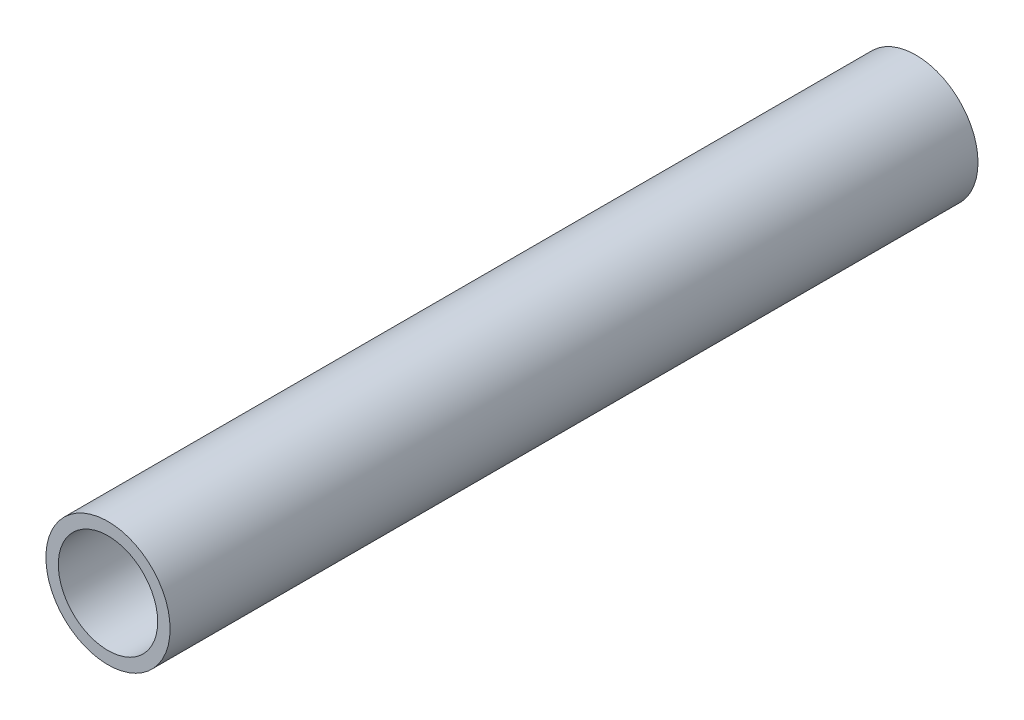
ISO-10303-21;
HEADER;
FILE_DESCRIPTION(('STEP AP214'),'2;1');
FILE_NAME('part.step','',(''),(''),'','','');
FILE_SCHEMA(('AUTOMOTIVE_DESIGN { 1 0 10303 214 1 1 1 1 }'));
ENDSEC;
DATA;
#1=APPLICATION_CONTEXT('core data for automotive mechanical design processes');
#2=APPLICATION_PROTOCOL_DEFINITION('international standard','automotive_design',2000,#1);
#3=PRODUCT_CONTEXT('',#1,'mechanical');
#4=PRODUCT('Part','Part','',(#3));
#5=PRODUCT_RELATED_PRODUCT_CATEGORY('part','',(#4));
#6=PRODUCT_DEFINITION_FORMATION('','',#4);
#7=PRODUCT_DEFINITION_CONTEXT('part definition',#1,'design');
#8=PRODUCT_DEFINITION('design','',#6,#7);
#9=PRODUCT_DEFINITION_SHAPE('','',#8);
#10=(LENGTH_UNIT() NAMED_UNIT(*) SI_UNIT(.MILLI.,.METRE.));
#11=(NAMED_UNIT(*) PLANE_ANGLE_UNIT() SI_UNIT($,.RADIAN.));
#12=(NAMED_UNIT(*) SI_UNIT($,.STERADIAN.) SOLID_ANGLE_UNIT());
#13=UNCERTAINTY_MEASURE_WITH_UNIT(LENGTH_MEASURE(1.E-05),#10,'distance_accuracy_value','');
#14=(GEOMETRIC_REPRESENTATION_CONTEXT(3) GLOBAL_UNCERTAINTY_ASSIGNED_CONTEXT((#13)) GLOBAL_UNIT_ASSIGNED_CONTEXT((#10,
#11,#12)) REPRESENTATION_CONTEXT('',''));
#15=CARTESIAN_POINT('',(0.,0.,0.));
#16=DIRECTION('',(0.,0.,1.));
#17=DIRECTION('',(1.,0.,0.));
#18=AXIS2_PLACEMENT_3D('',#15,#16,#17);
#19=CARTESIAN_POINT('',(0.,0.,16.2600000000011));
#20=DIRECTION('',(0.,0.,1.));
#21=DIRECTION('',(1.,0.,0.));
#22=AXIS2_PLACEMENT_3D('',#19,#20,#21);
#23=PLANE('',#22);
#24=CARTESIAN_POINT('',(0.,0.,16.2600000000011));
#25=DIRECTION('',(0.,0.,1.));
#26=DIRECTION('',(1.,0.,0.));
#27=AXIS2_PLACEMENT_3D('',#24,#25,#26);
#28=CIRCLE('',#27,1.25);
#29=CARTESIAN_POINT('',(1.25,0.,16.2600000000011));
#30=VERTEX_POINT('',#29);
#31=EDGE_CURVE('E10',#30,#30,#28,.T.);
#32=ORIENTED_EDGE('',*,*,#31,.T.);
#33=EDGE_LOOP('',(#32));
#34=FACE_BOUND('',#33,.T.);
#35=CARTESIAN_POINT('',(0.,0.,16.2600000000011));
#36=DIRECTION('',(0.,0.,1.));
#37=DIRECTION('',(1.,0.,0.));
#38=AXIS2_PLACEMENT_3D('',#35,#36,#37);
#39=CIRCLE('',#38,1.);
#40=CARTESIAN_POINT('',(1.,0.,16.2600000000011));
#41=VERTEX_POINT('',#40);
#42=EDGE_CURVE('E42',#41,#41,#39,.T.);
#43=ORIENTED_EDGE('',*,*,#42,.F.);
#44=EDGE_LOOP('',(#43));
#45=FACE_BOUND('',#44,.T.);
#46=ADVANCED_FACE('F31',(#34,#45),#23,.T.);
#47=CARTESIAN_POINT('',(0.,0.,0.));
#48=DIRECTION('',(0.,0.,1.));
#49=DIRECTION('',(1.,0.,0.));
#50=AXIS2_PLACEMENT_3D('',#47,#48,#49);
#51=PLANE('',#50);
#52=CARTESIAN_POINT('',(0.,0.,0.));
#53=DIRECTION('',(0.,0.,1.));
#54=DIRECTION('',(1.,0.,0.));
#55=AXIS2_PLACEMENT_3D('',#52,#53,#54);
#56=CIRCLE('',#55,1.25);
#57=CARTESIAN_POINT('',(1.25,0.,0.));
#58=VERTEX_POINT('',#57);
#59=EDGE_CURVE('E35',#58,#58,#56,.T.);
#60=ORIENTED_EDGE('',*,*,#59,.F.);
#61=EDGE_LOOP('',(#60));
#62=FACE_BOUND('',#61,.T.);
#63=CARTESIAN_POINT('',(0.,0.,0.));
#64=DIRECTION('',(0.,0.,1.));
#65=DIRECTION('',(1.,0.,0.));
#66=AXIS2_PLACEMENT_3D('',#63,#64,#65);
#67=CIRCLE('',#66,1.);
#68=CARTESIAN_POINT('',(1.,0.,0.));
#69=VERTEX_POINT('',#68);
#70=EDGE_CURVE('E44',#69,#69,#67,.T.);
#71=ORIENTED_EDGE('',*,*,#70,.T.);
#72=EDGE_LOOP('',(#71));
#73=FACE_BOUND('',#72,.T.);
#74=ADVANCED_FACE('F54',(#62,#73),#51,.F.);
#75=CARTESIAN_POINT('',(0.,0.,16.2600000000011));
#76=DIRECTION('',(0.,0.,-1.));
#77=DIRECTION('',(-1.,0.,0.));
#78=AXIS2_PLACEMENT_3D('',#75,#76,#77);
#79=CYLINDRICAL_SURFACE('',#78,1.25);
#80=ORIENTED_EDGE('',*,*,#31,.F.);
#81=EDGE_LOOP('',(#80));
#82=FACE_BOUND('',#81,.T.);
#83=ORIENTED_EDGE('',*,*,#59,.T.);
#84=EDGE_LOOP('',(#83));
#85=FACE_BOUND('',#84,.T.);
#86=ADVANCED_FACE('F33',(#82,#85),#79,.T.);
#87=CARTESIAN_POINT('',(0.,0.,16.2600000000011));
#88=DIRECTION('',(0.,0.,-1.));
#89=DIRECTION('',(-1.,0.,0.));
#90=AXIS2_PLACEMENT_3D('',#87,#88,#89);
#91=CYLINDRICAL_SURFACE('',#90,1.);
#92=ORIENTED_EDGE('',*,*,#42,.T.);
#93=EDGE_LOOP('',(#92));
#94=FACE_BOUND('',#93,.T.);
#95=ORIENTED_EDGE('',*,*,#70,.F.);
#96=EDGE_LOOP('',(#95));
#97=FACE_BOUND('',#96,.T.);
#98=ADVANCED_FACE('F50',(#94,#97),#91,.F.);
#99=CLOSED_SHELL('',(#46,#74,#86,#98));
#100=MANIFOLD_SOLID_BREP('B2',#99);
#101=ADVANCED_BREP_SHAPE_REPRESENTATION('',(#18,#100),#14);
#102=SHAPE_DEFINITION_REPRESENTATION(#9,#101);
ENDSEC;
END-ISO-10303-21;
